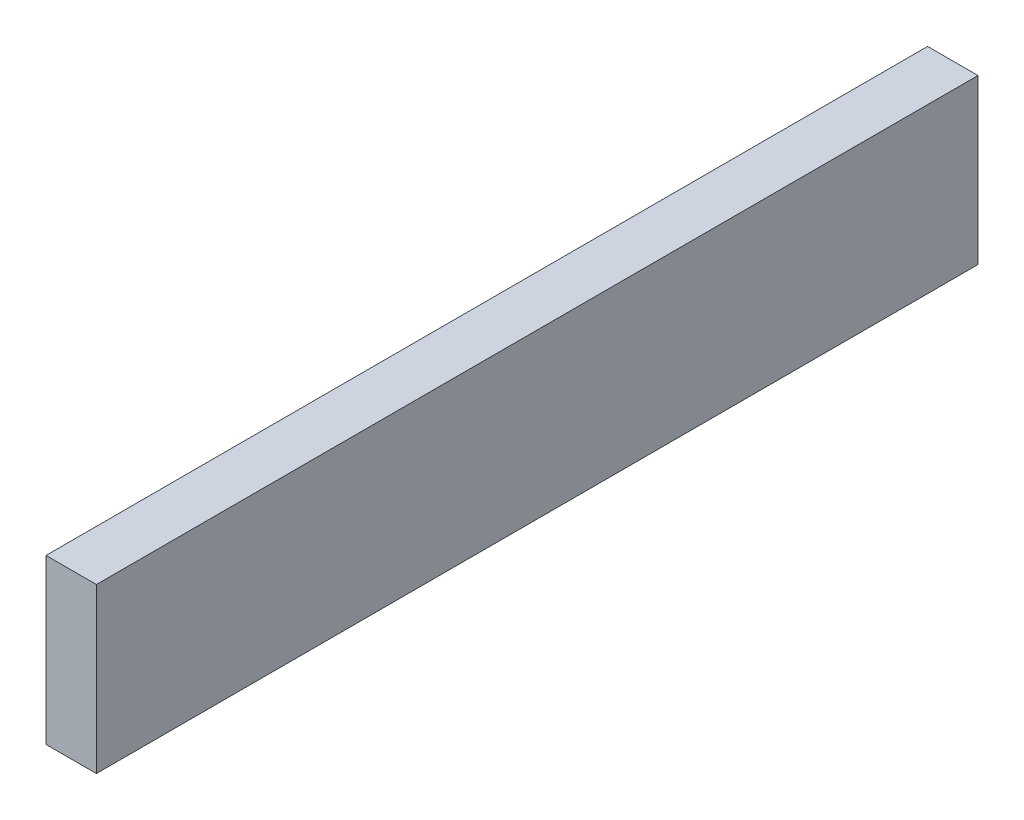
ISO-10303-21;
HEADER;
FILE_DESCRIPTION(('STEP AP214'),'2;1');
FILE_NAME('part.step','',(''),(''),'','','');
FILE_SCHEMA(('AUTOMOTIVE_DESIGN { 1 0 10303 214 1 1 1 1 }'));
ENDSEC;
DATA;
#1=APPLICATION_CONTEXT('core data for automotive mechanical design processes');
#2=APPLICATION_PROTOCOL_DEFINITION('international standard','automotive_design',2000,#1);
#3=PRODUCT_CONTEXT('',#1,'mechanical');
#4=PRODUCT('Part','Part','',(#3));
#5=PRODUCT_RELATED_PRODUCT_CATEGORY('part','',(#4));
#6=PRODUCT_DEFINITION_FORMATION('','',#4);
#7=PRODUCT_DEFINITION_CONTEXT('part definition',#1,'design');
#8=PRODUCT_DEFINITION('design','',#6,#7);
#9=PRODUCT_DEFINITION_SHAPE('','',#8);
#10=(LENGTH_UNIT() NAMED_UNIT(*) SI_UNIT(.MILLI.,.METRE.));
#11=(NAMED_UNIT(*) PLANE_ANGLE_UNIT() SI_UNIT($,.RADIAN.));
#12=(NAMED_UNIT(*) SI_UNIT($,.STERADIAN.) SOLID_ANGLE_UNIT());
#13=UNCERTAINTY_MEASURE_WITH_UNIT(LENGTH_MEASURE(1.E-05),#10,'distance_accuracy_value','');
#14=(GEOMETRIC_REPRESENTATION_CONTEXT(3) GLOBAL_UNCERTAINTY_ASSIGNED_CONTEXT((#13)) GLOBAL_UNIT_ASSIGNED_CONTEXT((#10,
#11,#12)) REPRESENTATION_CONTEXT('',''));
#15=CARTESIAN_POINT('',(0.,0.,0.));
#16=DIRECTION('',(0.,0.,1.));
#17=DIRECTION('',(1.,0.,0.));
#18=AXIS2_PLACEMENT_3D('',#15,#16,#17);
#19=CARTESIAN_POINT('',(0.,0.,70.));
#20=DIRECTION('',(1.,0.,0.));
#21=DIRECTION('',(0.,0.,-1.));
#22=AXIS2_PLACEMENT_3D('',#19,#20,#21);
#23=PLANE('',#22);
#24=DIRECTION('',(0.,-1.,0.));
#25=VECTOR('',#24,1.);
#26=CARTESIAN_POINT('',(0.,0.,0.));
#27=LINE('',#26,#25);
#28=CARTESIAN_POINT('',(0.,13.,0.));
#29=VERTEX_POINT('',#28);
#30=CARTESIAN_POINT('',(0.,0.,0.));
#31=VERTEX_POINT('',#30);
#32=EDGE_CURVE('E109',#29,#31,#27,.T.);
#33=ORIENTED_EDGE('',*,*,#32,.T.);
#34=DIRECTION('',(0.,0.,-1.));
#35=VECTOR('',#34,1.);
#36=CARTESIAN_POINT('',(0.,0.,70.));
#37=LINE('',#36,#35);
#38=CARTESIAN_POINT('',(0.,0.,70.));
#39=VERTEX_POINT('',#38);
#40=EDGE_CURVE('E11',#39,#31,#37,.T.);
#41=ORIENTED_EDGE('',*,*,#40,.F.);
#42=DIRECTION('',(0.,-1.,0.));
#43=VECTOR('',#42,1.);
#44=CARTESIAN_POINT('',(0.,0.,70.));
#45=LINE('',#44,#43);
#46=CARTESIAN_POINT('',(0.,13.,70.));
#47=VERTEX_POINT('',#46);
#48=EDGE_CURVE('E93',#47,#39,#45,.T.);
#49=ORIENTED_EDGE('',*,*,#48,.F.);
#50=DIRECTION('',(0.,0.,-1.));
#51=VECTOR('',#50,1.);
#52=CARTESIAN_POINT('',(0.,13.,70.));
#53=LINE('',#52,#51);
#54=EDGE_CURVE('E105',#47,#29,#53,.T.);
#55=ORIENTED_EDGE('',*,*,#54,.T.);
#56=EDGE_LOOP('',(#33,#41,#49,#55));
#57=FACE_BOUND('',#56,.T.);
#58=ADVANCED_FACE('F41',(#57),#23,.F.);
#59=CARTESIAN_POINT('',(0.,0.,70.));
#60=DIRECTION('',(0.,1.,0.));
#61=DIRECTION('',(0.,0.,1.));
#62=AXIS2_PLACEMENT_3D('',#59,#60,#61);
#63=PLANE('',#62);
#64=DIRECTION('',(1.,0.,0.));
#65=VECTOR('',#64,1.);
#66=CARTESIAN_POINT('',(0.,0.,0.));
#67=LINE('',#66,#65);
#68=CARTESIAN_POINT('',(4.,0.,0.));
#69=VERTEX_POINT('',#68);
#70=EDGE_CURVE('E98',#31,#69,#67,.T.);
#71=ORIENTED_EDGE('',*,*,#70,.T.);
#72=DIRECTION('',(0.,0.,-1.));
#73=VECTOR('',#72,1.);
#74=CARTESIAN_POINT('',(4.,0.,70.));
#75=LINE('',#74,#73);
#76=CARTESIAN_POINT('',(4.,0.,70.));
#77=VERTEX_POINT('',#76);
#78=EDGE_CURVE('E50',#77,#69,#75,.T.);
#79=ORIENTED_EDGE('',*,*,#78,.F.);
#80=DIRECTION('',(1.,0.,0.));
#81=VECTOR('',#80,1.);
#82=CARTESIAN_POINT('',(0.,0.,70.));
#83=LINE('',#82,#81);
#84=EDGE_CURVE('E88',#39,#77,#83,.T.);
#85=ORIENTED_EDGE('',*,*,#84,.F.);
#86=ORIENTED_EDGE('',*,*,#40,.T.);
#87=EDGE_LOOP('',(#71,#79,#85,#86));
#88=FACE_BOUND('',#87,.T.);
#89=ADVANCED_FACE('F97',(#88),#63,.F.);
#90=CARTESIAN_POINT('',(4.,0.,70.));
#91=DIRECTION('',(-1.,0.,0.));
#92=DIRECTION('',(0.,0.,1.));
#93=AXIS2_PLACEMENT_3D('',#90,#91,#92);
#94=PLANE('',#93);
#95=DIRECTION('',(0.,1.,0.));
#96=VECTOR('',#95,1.);
#97=CARTESIAN_POINT('',(4.,0.,0.));
#98=LINE('',#97,#96);
#99=CARTESIAN_POINT('',(4.,13.,0.));
#100=VERTEX_POINT('',#99);
#101=EDGE_CURVE('E75',#69,#100,#98,.T.);
#102=ORIENTED_EDGE('',*,*,#101,.T.);
#103=DIRECTION('',(0.,0.,-1.));
#104=VECTOR('',#103,1.);
#105=CARTESIAN_POINT('',(4.,13.,70.));
#106=LINE('',#105,#104);
#107=CARTESIAN_POINT('',(4.,13.,70.));
#108=VERTEX_POINT('',#107);
#109=EDGE_CURVE('E100',#108,#100,#106,.T.);
#110=ORIENTED_EDGE('',*,*,#109,.F.);
#111=DIRECTION('',(0.,1.,0.));
#112=VECTOR('',#111,1.);
#113=CARTESIAN_POINT('',(4.,0.,70.));
#114=LINE('',#113,#112);
#115=EDGE_CURVE('E91',#77,#108,#114,.T.);
#116=ORIENTED_EDGE('',*,*,#115,.F.);
#117=ORIENTED_EDGE('',*,*,#78,.T.);
#118=EDGE_LOOP('',(#102,#110,#116,#117));
#119=FACE_BOUND('',#118,.T.);
#120=ADVANCED_FACE('F101',(#119),#94,.F.);
#121=CARTESIAN_POINT('',(0.,13.,70.));
#122=DIRECTION('',(0.,-1.,0.));
#123=DIRECTION('',(0.,0.,-1.));
#124=AXIS2_PLACEMENT_3D('',#121,#122,#123);
#125=PLANE('',#124);
#126=DIRECTION('',(-1.,0.,0.));
#127=VECTOR('',#126,1.);
#128=CARTESIAN_POINT('',(0.,13.,0.));
#129=LINE('',#128,#127);
#130=EDGE_CURVE('E81',#100,#29,#129,.T.);
#131=ORIENTED_EDGE('',*,*,#130,.T.);
#132=ORIENTED_EDGE('',*,*,#54,.F.);
#133=DIRECTION('',(-1.,0.,0.));
#134=VECTOR('',#133,1.);
#135=CARTESIAN_POINT('',(0.,13.,70.));
#136=LINE('',#135,#134);
#137=EDGE_CURVE('E58',#108,#47,#136,.T.);
#138=ORIENTED_EDGE('',*,*,#137,.F.);
#139=ORIENTED_EDGE('',*,*,#109,.T.);
#140=EDGE_LOOP('',(#131,#132,#138,#139));
#141=FACE_BOUND('',#140,.T.);
#142=ADVANCED_FACE('F122',(#141),#125,.F.);
#143=CARTESIAN_POINT('',(0.,0.,70.));
#144=DIRECTION('',(0.,0.,-1.));
#145=DIRECTION('',(-1.,0.,0.));
#146=AXIS2_PLACEMENT_3D('',#143,#144,#145);
#147=PLANE('',#146);
#148=ORIENTED_EDGE('',*,*,#48,.T.);
#149=ORIENTED_EDGE('',*,*,#84,.T.);
#150=ORIENTED_EDGE('',*,*,#115,.T.);
#151=ORIENTED_EDGE('',*,*,#137,.T.);
#152=EDGE_LOOP('',(#148,#149,#150,#151));
#153=FACE_BOUND('',#152,.T.);
#154=ADVANCED_FACE('F89',(#153),#147,.F.);
#155=CARTESIAN_POINT('',(0.,0.,0.));
#156=DIRECTION('',(0.,0.,-1.));
#157=DIRECTION('',(-1.,0.,0.));
#158=AXIS2_PLACEMENT_3D('',#155,#156,#157);
#159=PLANE('',#158);
#160=ORIENTED_EDGE('',*,*,#32,.F.);
#161=ORIENTED_EDGE('',*,*,#130,.F.);
#162=ORIENTED_EDGE('',*,*,#101,.F.);
#163=ORIENTED_EDGE('',*,*,#70,.F.);
#164=EDGE_LOOP('',(#160,#161,#162,#163));
#165=FACE_BOUND('',#164,.T.);
#166=ADVANCED_FACE('F125',(#165),#159,.T.);
#167=CLOSED_SHELL('',(#58,#89,#120,#142,#154,#166));
#168=MANIFOLD_SOLID_BREP('B2',#167);
#169=ADVANCED_BREP_SHAPE_REPRESENTATION('',(#18,#168),#14);
#170=SHAPE_DEFINITION_REPRESENTATION(#9,#169);
ENDSEC;
END-ISO-10303-21;
